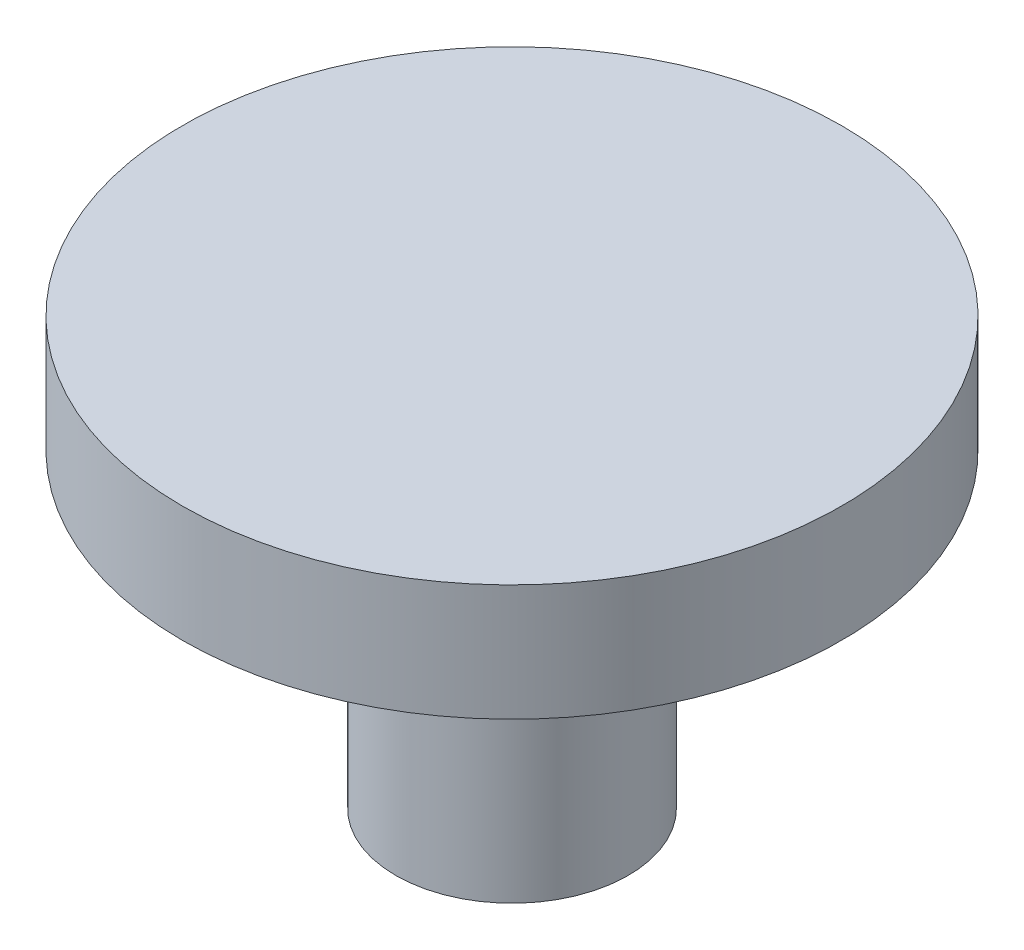
ISO-10303-21;
HEADER;
FILE_DESCRIPTION(('STEP AP214'),'2;1');
FILE_NAME('part.step','',(''),(''),'','','');
FILE_SCHEMA(('AUTOMOTIVE_DESIGN { 1 0 10303 214 1 1 1 1 }'));
ENDSEC;
DATA;
#1=APPLICATION_CONTEXT('core data for automotive mechanical design processes');
#2=APPLICATION_PROTOCOL_DEFINITION('international standard','automotive_design',2000,#1);
#3=PRODUCT_CONTEXT('',#1,'mechanical');
#4=PRODUCT('Part','Part','',(#3));
#5=PRODUCT_RELATED_PRODUCT_CATEGORY('part','',(#4));
#6=PRODUCT_DEFINITION_FORMATION('','',#4);
#7=PRODUCT_DEFINITION_CONTEXT('part definition',#1,'design');
#8=PRODUCT_DEFINITION('design','',#6,#7);
#9=PRODUCT_DEFINITION_SHAPE('','',#8);
#10=(LENGTH_UNIT() NAMED_UNIT(*) SI_UNIT(.MILLI.,.METRE.));
#11=(NAMED_UNIT(*) PLANE_ANGLE_UNIT() SI_UNIT($,.RADIAN.));
#12=(NAMED_UNIT(*) SI_UNIT($,.STERADIAN.) SOLID_ANGLE_UNIT());
#13=UNCERTAINTY_MEASURE_WITH_UNIT(LENGTH_MEASURE(1.E-05),#10,'distance_accuracy_value','');
#14=(GEOMETRIC_REPRESENTATION_CONTEXT(3) GLOBAL_UNCERTAINTY_ASSIGNED_CONTEXT((#13)) GLOBAL_UNIT_ASSIGNED_CONTEXT((#10,
#11,#12)) REPRESENTATION_CONTEXT('',''));
#15=CARTESIAN_POINT('',(0.,0.,0.));
#16=DIRECTION('',(0.,0.,1.));
#17=DIRECTION('',(1.,0.,0.));
#18=AXIS2_PLACEMENT_3D('',#15,#16,#17);
#19=CARTESIAN_POINT('',(0.,1.5,0.));
#20=DIRECTION('',(0.,1.,0.));
#21=DIRECTION('',(0.,0.,1.));
#22=AXIS2_PLACEMENT_3D('',#19,#20,#21);
#23=PLANE('',#22);
#24=CARTESIAN_POINT('',(0.,1.5,0.));
#25=DIRECTION('',(0.,1.,0.));
#26=DIRECTION('',(0.,0.,1.));
#27=AXIS2_PLACEMENT_3D('',#24,#25,#26);
#28=CIRCLE('',#27,4.25);
#29=CARTESIAN_POINT('',(0.,1.5,4.25));
#30=VERTEX_POINT('',#29);
#31=EDGE_CURVE('E10',#30,#30,#28,.T.);
#32=ORIENTED_EDGE('',*,*,#31,.T.);
#33=EDGE_LOOP('',(#32));
#34=FACE_BOUND('',#33,.T.);
#35=ADVANCED_FACE('F30',(#34),#23,.T.);
#36=CARTESIAN_POINT('',(0.,3.41231597338198,0.));
#37=DIRECTION('',(0.,1.,0.));
#38=DIRECTION('',(0.,0.,1.));
#39=AXIS2_PLACEMENT_3D('',#36,#37,#38);
#40=CYLINDRICAL_SURFACE('',#39,4.25);
#41=CARTESIAN_POINT('',(0.,0.,0.));
#42=DIRECTION('',(0.,1.,0.));
#43=DIRECTION('',(0.,0.,1.));
#44=AXIS2_PLACEMENT_3D('',#41,#42,#43);
#45=CIRCLE('',#44,4.25);
#46=CARTESIAN_POINT('',(0.,0.,4.25));
#47=VERTEX_POINT('',#46);
#48=EDGE_CURVE('E36',#47,#47,#45,.T.);
#49=ORIENTED_EDGE('',*,*,#48,.T.);
#50=EDGE_LOOP('',(#49));
#51=FACE_BOUND('',#50,.T.);
#52=ORIENTED_EDGE('',*,*,#31,.F.);
#53=EDGE_LOOP('',(#52));
#54=FACE_BOUND('',#53,.T.);
#55=ADVANCED_FACE('F62',(#51,#54),#40,.T.);
#56=CARTESIAN_POINT('',(-4.25,0.,0.));
#57=DIRECTION('',(0.,-1.,0.));
#58=DIRECTION('',(0.,0.,-1.));
#59=AXIS2_PLACEMENT_3D('',#56,#57,#58);
#60=PLANE('',#59);
#61=CARTESIAN_POINT('',(0.,0.,0.));
#62=DIRECTION('',(0.,1.,0.));
#63=DIRECTION('',(0.,0.,1.));
#64=AXIS2_PLACEMENT_3D('',#61,#62,#63);
#65=CIRCLE('',#64,1.5);
#66=CARTESIAN_POINT('',(0.,0.,1.5));
#67=VERTEX_POINT('',#66);
#68=EDGE_CURVE('E40',#67,#67,#65,.T.);
#69=ORIENTED_EDGE('',*,*,#68,.T.);
#70=EDGE_LOOP('',(#69));
#71=FACE_BOUND('',#70,.T.);
#72=ORIENTED_EDGE('',*,*,#48,.F.);
#73=EDGE_LOOP('',(#72));
#74=FACE_BOUND('',#73,.T.);
#75=ADVANCED_FACE('F59',(#71,#74),#60,.T.);
#76=CARTESIAN_POINT('',(0.,3.41231597338198,0.));
#77=DIRECTION('',(0.,1.,0.));
#78=DIRECTION('',(0.,0.,1.));
#79=AXIS2_PLACEMENT_3D('',#76,#77,#78);
#80=CYLINDRICAL_SURFACE('',#79,1.5);
#81=CARTESIAN_POINT('',(0.,-4.,0.));
#82=DIRECTION('',(0.,1.,0.));
#83=DIRECTION('',(0.,0.,1.));
#84=AXIS2_PLACEMENT_3D('',#81,#82,#83);
#85=CIRCLE('',#84,1.5);
#86=CARTESIAN_POINT('',(0.,-4.,1.5));
#87=VERTEX_POINT('',#86);
#88=EDGE_CURVE('E44',#87,#87,#85,.T.);
#89=ORIENTED_EDGE('',*,*,#88,.T.);
#90=EDGE_LOOP('',(#89));
#91=FACE_BOUND('',#90,.T.);
#92=ORIENTED_EDGE('',*,*,#68,.F.);
#93=EDGE_LOOP('',(#92));
#94=FACE_BOUND('',#93,.T.);
#95=ADVANCED_FACE('F50',(#91,#94),#80,.T.);
#96=CARTESIAN_POINT('',(-1.5,-4.,0.));
#97=DIRECTION('',(0.,-1.,0.));
#98=DIRECTION('',(0.,0.,-1.));
#99=AXIS2_PLACEMENT_3D('',#96,#97,#98);
#100=PLANE('',#99);
#101=ORIENTED_EDGE('',*,*,#88,.F.);
#102=EDGE_LOOP('',(#101));
#103=FACE_BOUND('',#102,.T.);
#104=ADVANCED_FACE('F53',(#103),#100,.T.);
#105=CLOSED_SHELL('',(#35,#55,#75,#95,#104));
#106=MANIFOLD_SOLID_BREP('B2',#105);
#107=ADVANCED_BREP_SHAPE_REPRESENTATION('',(#18,#106),#14);
#108=SHAPE_DEFINITION_REPRESENTATION(#9,#107);
ENDSEC;
END-ISO-10303-21;
